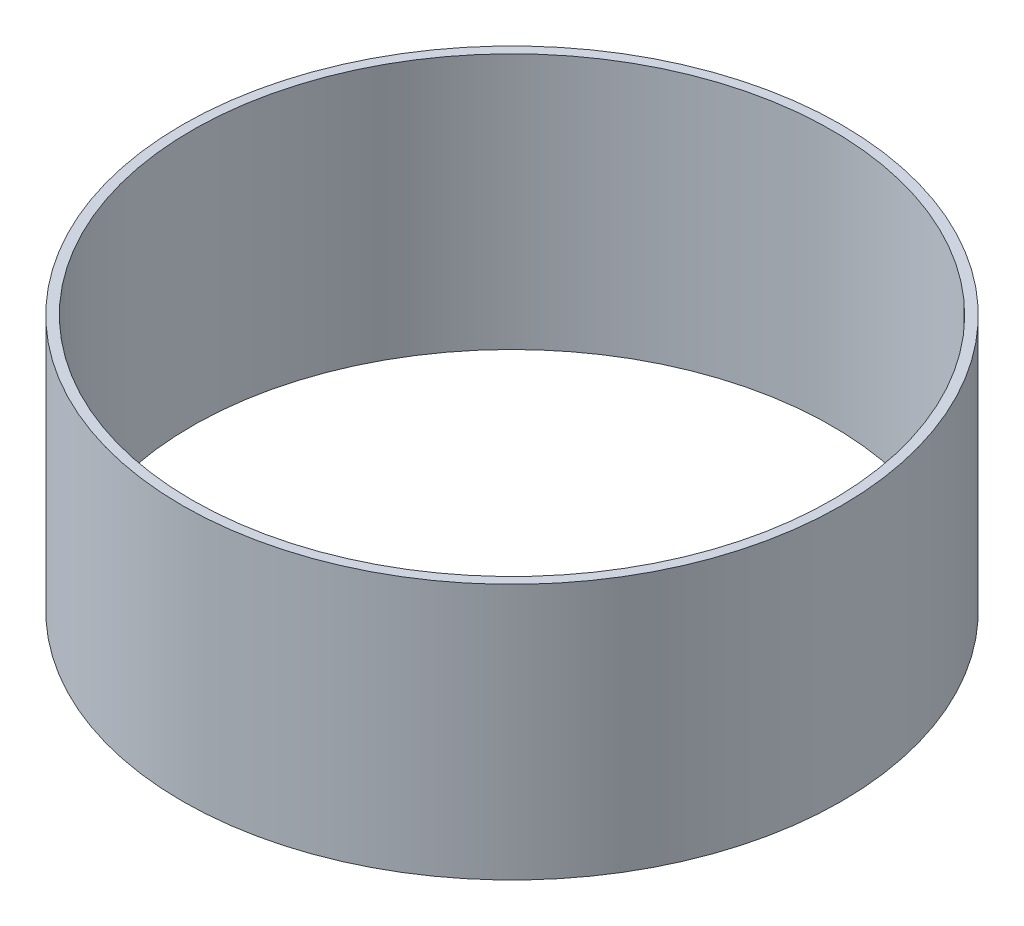
ISO-10303-21;
HEADER;
FILE_DESCRIPTION(('STEP AP214'),'2;1');
FILE_NAME('part.step','',(''),(''),'','','');
FILE_SCHEMA(('AUTOMOTIVE_DESIGN { 1 0 10303 214 1 1 1 1 }'));
ENDSEC;
DATA;
#1=APPLICATION_CONTEXT('core data for automotive mechanical design processes');
#2=APPLICATION_PROTOCOL_DEFINITION('international standard','automotive_design',2000,#1);
#3=PRODUCT_CONTEXT('',#1,'mechanical');
#4=PRODUCT('Part','Part','',(#3));
#5=PRODUCT_RELATED_PRODUCT_CATEGORY('part','',(#4));
#6=PRODUCT_DEFINITION_FORMATION('','',#4);
#7=PRODUCT_DEFINITION_CONTEXT('part definition',#1,'design');
#8=PRODUCT_DEFINITION('design','',#6,#7);
#9=PRODUCT_DEFINITION_SHAPE('','',#8);
#10=(LENGTH_UNIT() NAMED_UNIT(*) SI_UNIT(.MILLI.,.METRE.));
#11=(NAMED_UNIT(*) PLANE_ANGLE_UNIT() SI_UNIT($,.RADIAN.));
#12=(NAMED_UNIT(*) SI_UNIT($,.STERADIAN.) SOLID_ANGLE_UNIT());
#13=UNCERTAINTY_MEASURE_WITH_UNIT(LENGTH_MEASURE(1.E-05),#10,'distance_accuracy_value','');
#14=(GEOMETRIC_REPRESENTATION_CONTEXT(3) GLOBAL_UNCERTAINTY_ASSIGNED_CONTEXT((#13)) GLOBAL_UNIT_ASSIGNED_CONTEXT((#10,
#11,#12)) REPRESENTATION_CONTEXT('',''));
#15=CARTESIAN_POINT('',(0.,0.,0.));
#16=DIRECTION('',(0.,0.,1.));
#17=DIRECTION('',(1.,0.,0.));
#18=AXIS2_PLACEMENT_3D('',#15,#16,#17);
#19=CARTESIAN_POINT('',(0.,25.4,0.));
#20=DIRECTION('',(0.,1.,0.));
#21=DIRECTION('',(0.,0.,1.));
#22=AXIS2_PLACEMENT_3D('',#19,#20,#21);
#23=PLANE('',#22);
#24=CARTESIAN_POINT('',(0.,25.4,0.));
#25=DIRECTION('',(0.,1.,0.));
#26=DIRECTION('',(0.,0.,1.));
#27=AXIS2_PLACEMENT_3D('',#24,#25,#26);
#28=CIRCLE('',#27,65.405);
#29=CARTESIAN_POINT('',(0.,25.4,65.405));
#30=VERTEX_POINT('',#29);
#31=EDGE_CURVE('E10',#30,#30,#28,.T.);
#32=ORIENTED_EDGE('',*,*,#31,.T.);
#33=EDGE_LOOP('',(#32));
#34=FACE_BOUND('',#33,.T.);
#35=CARTESIAN_POINT('',(0.,25.4,0.));
#36=DIRECTION('',(0.,1.,0.));
#37=DIRECTION('',(0.,0.,1.));
#38=AXIS2_PLACEMENT_3D('',#35,#36,#37);
#39=CIRCLE('',#38,63.5);
#40=CARTESIAN_POINT('',(0.,25.4,63.5));
#41=VERTEX_POINT('',#40);
#42=EDGE_CURVE('E54',#41,#41,#39,.T.);
#43=ORIENTED_EDGE('',*,*,#42,.F.);
#44=EDGE_LOOP('',(#43));
#45=FACE_BOUND('',#44,.T.);
#46=ADVANCED_FACE('F41',(#34,#45),#23,.T.);
#47=CARTESIAN_POINT('',(0.,-25.4,0.));
#48=DIRECTION('',(0.,1.,0.));
#49=DIRECTION('',(0.,0.,1.));
#50=AXIS2_PLACEMENT_3D('',#47,#48,#49);
#51=PLANE('',#50);
#52=CARTESIAN_POINT('',(0.,-25.4,0.));
#53=DIRECTION('',(0.,1.,0.));
#54=DIRECTION('',(0.,0.,1.));
#55=AXIS2_PLACEMENT_3D('',#52,#53,#54);
#56=CIRCLE('',#55,65.405);
#57=CARTESIAN_POINT('',(0.,-25.4,65.405));
#58=VERTEX_POINT('',#57);
#59=EDGE_CURVE('E45',#58,#58,#56,.T.);
#60=ORIENTED_EDGE('',*,*,#59,.F.);
#61=EDGE_LOOP('',(#60));
#62=FACE_BOUND('',#61,.T.);
#63=CARTESIAN_POINT('',(0.,-25.4,0.));
#64=DIRECTION('',(0.,1.,0.));
#65=DIRECTION('',(0.,0.,1.));
#66=AXIS2_PLACEMENT_3D('',#63,#64,#65);
#67=CIRCLE('',#66,63.5);
#68=CARTESIAN_POINT('',(0.,-25.4,63.5));
#69=VERTEX_POINT('',#68);
#70=EDGE_CURVE('E56',#69,#69,#67,.T.);
#71=ORIENTED_EDGE('',*,*,#70,.T.);
#72=EDGE_LOOP('',(#71));
#73=FACE_BOUND('',#72,.T.);
#74=ADVANCED_FACE('F68',(#62,#73),#51,.F.);
#75=CARTESIAN_POINT('',(0.,25.4,0.));
#76=DIRECTION('',(0.,-1.,0.));
#77=DIRECTION('',(0.,0.,-1.));
#78=AXIS2_PLACEMENT_3D('',#75,#76,#77);
#79=CYLINDRICAL_SURFACE('',#78,65.405);
#80=ORIENTED_EDGE('',*,*,#31,.F.);
#81=EDGE_LOOP('',(#80));
#82=FACE_BOUND('',#81,.T.);
#83=ORIENTED_EDGE('',*,*,#59,.T.);
#84=EDGE_LOOP('',(#83));
#85=FACE_BOUND('',#84,.T.);
#86=ADVANCED_FACE('F43',(#82,#85),#79,.T.);
#87=CARTESIAN_POINT('',(0.,25.4,0.));
#88=DIRECTION('',(0.,-1.,0.));
#89=DIRECTION('',(0.,0.,-1.));
#90=AXIS2_PLACEMENT_3D('',#87,#88,#89);
#91=CYLINDRICAL_SURFACE('',#90,63.5);
#92=ORIENTED_EDGE('',*,*,#42,.T.);
#93=EDGE_LOOP('',(#92));
#94=FACE_BOUND('',#93,.T.);
#95=ORIENTED_EDGE('',*,*,#70,.F.);
#96=EDGE_LOOP('',(#95));
#97=FACE_BOUND('',#96,.T.);
#98=ADVANCED_FACE('F64',(#94,#97),#91,.F.);
#99=CLOSED_SHELL('',(#46,#74,#86,#98));
#100=MANIFOLD_SOLID_BREP('B2',#99);
#101=ADVANCED_BREP_SHAPE_REPRESENTATION('',(#18,#100),#14);
#102=SHAPE_DEFINITION_REPRESENTATION(#9,#101);
ENDSEC;
END-ISO-10303-21;
